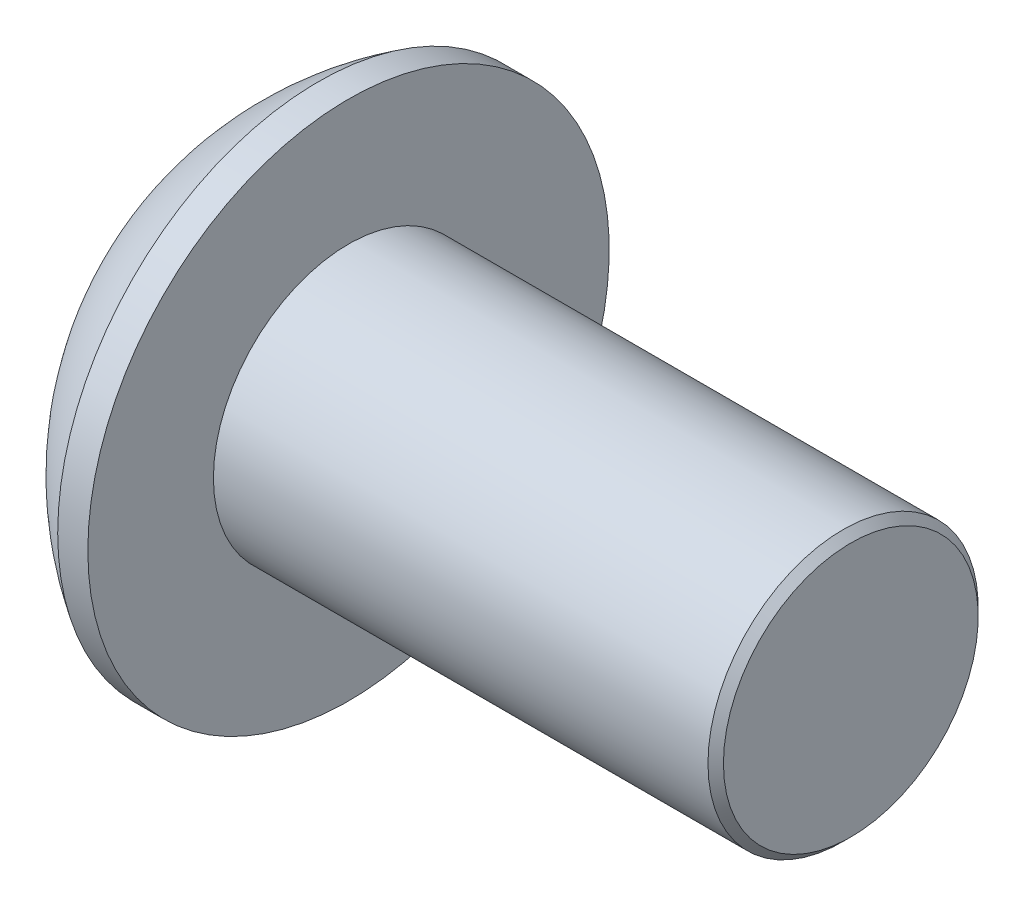
ISO-10303-21;
HEADER;
FILE_DESCRIPTION(('STEP AP214'),'2;1');
FILE_NAME('part.step','',(''),(''),'','','');
FILE_SCHEMA(('AUTOMOTIVE_DESIGN { 1 0 10303 214 1 1 1 1 }'));
ENDSEC;
DATA;
#1=APPLICATION_CONTEXT('core data for automotive mechanical design processes');
#2=APPLICATION_PROTOCOL_DEFINITION('international standard','automotive_design',2000,#1);
#3=PRODUCT_CONTEXT('',#1,'mechanical');
#4=PRODUCT('Part','Part','',(#3));
#5=PRODUCT_RELATED_PRODUCT_CATEGORY('part','',(#4));
#6=PRODUCT_DEFINITION_FORMATION('','',#4);
#7=PRODUCT_DEFINITION_CONTEXT('part definition',#1,'design');
#8=PRODUCT_DEFINITION('design','',#6,#7);
#9=PRODUCT_DEFINITION_SHAPE('','',#8);
#10=(LENGTH_UNIT() NAMED_UNIT(*) SI_UNIT(.MILLI.,.METRE.));
#11=(NAMED_UNIT(*) PLANE_ANGLE_UNIT() SI_UNIT($,.RADIAN.));
#12=(NAMED_UNIT(*) SI_UNIT($,.STERADIAN.) SOLID_ANGLE_UNIT());
#13=UNCERTAINTY_MEASURE_WITH_UNIT(LENGTH_MEASURE(1.E-05),#10,'distance_accuracy_value','');
#14=(GEOMETRIC_REPRESENTATION_CONTEXT(3) GLOBAL_UNCERTAINTY_ASSIGNED_CONTEXT((#13)) GLOBAL_UNIT_ASSIGNED_CONTEXT((#10,
#11,#12)) REPRESENTATION_CONTEXT('',''));
#15=CARTESIAN_POINT('',(0.,0.,0.));
#16=DIRECTION('',(0.,0.,1.));
#17=DIRECTION('',(1.,0.,0.));
#18=AXIS2_PLACEMENT_3D('',#15,#16,#17);
#19=CARTESIAN_POINT('',(8.2042,0.,0.));
#20=DIRECTION('',(-1.,0.,0.));
#21=DIRECTION('',(0.,0.,1.));
#22=AXIS2_PLACEMENT_3D('',#19,#20,#21);
#23=PLANE('',#22);
#24=CARTESIAN_POINT('',(8.20419999990918,0.,0.));
#25=DIRECTION('',(-1.,0.,0.));
#26=DIRECTION('',(0.,0.,1.));
#27=AXIS2_PLACEMENT_3D('',#24,#25,#26);
#28=CIRCLE('',#27,1.6103600000292);
#29=CARTESIAN_POINT('',(8.20419999990918,0.,1.61036000002918));
#30=VERTEX_POINT('',#29);
#31=EDGE_CURVE('E21',#30,#30,#28,.T.);
#32=ORIENTED_EDGE('',*,*,#31,.F.);
#33=EDGE_LOOP('',(#32));
#34=FACE_BOUND('',#33,.T.);
#35=ADVANCED_FACE('F17',(#34),#23,.F.);
#36=CARTESIAN_POINT('',(8.10641000015266,0.,0.));
#37=DIRECTION('',(-1.,0.,0.));
#38=DIRECTION('',(0.,0.,1.));
#39=AXIS2_PLACEMENT_3D('',#36,#37,#38);
#40=CONICAL_SURFACE('',#39,1.70814999972888,0.785398163106808);
#41=ORIENTED_EDGE('',*,*,#31,.T.);
#42=EDGE_LOOP('',(#41));
#43=FACE_BOUND('',#42,.T.);
#44=CARTESIAN_POINT('',(8.10641000047,0.,0.));
#45=DIRECTION('',(-1.,0.,0.));
#46=DIRECTION('',(0.,0.,1.));
#47=AXIS2_PLACEMENT_3D('',#44,#45,#46);
#48=CIRCLE('',#47,1.70815);
#49=CARTESIAN_POINT('',(8.10641000047,0.,1.70815));
#50=VERTEX_POINT('',#49);
#51=EDGE_CURVE('E109',#50,#50,#48,.T.);
#52=ORIENTED_EDGE('',*,*,#51,.F.);
#53=EDGE_LOOP('',(#52));
#54=FACE_BOUND('',#53,.T.);
#55=ADVANCED_FACE('F325',(#43,#54),#40,.T.);
#56=CARTESIAN_POINT('',(1.32080000014412,0.,0.));
#57=DIRECTION('',(-1.,0.,0.));
#58=DIRECTION('',(0.,0.,1.));
#59=AXIS2_PLACEMENT_3D('',#56,#57,#58);
#60=CONICAL_SURFACE('',#59,1.1937999997258,1.04719755090695);
#61=CARTESIAN_POINT('',(2.01004075140077,0.,3.41060513164848E-10));
#62=VERTEX_POINT('',#61);
#63=VERTEX_LOOP('',#62);
#64=FACE_BOUND('',#63,.T.);
#65=CARTESIAN_POINT('',(1.32079999998002,0.,0.));
#66=DIRECTION('',(-1.,0.,0.));
#67=DIRECTION('',(0.,0.,1.));
#68=AXIS2_PLACEMENT_3D('',#65,#66,#67);
#69=CIRCLE('',#68,1.19380000001001);
#70=CARTESIAN_POINT('',(1.32079999999001,-1.03386112704374,0.596900000002157));
#71=VERTEX_POINT('',#70);
#72=CARTESIAN_POINT('',(1.32079999999762,0.,1.1937999999933));
#73=VERTEX_POINT('',#72);
#74=EDGE_CURVE('E94',#71,#73,#69,.T.);
#75=ORIENTED_EDGE('',*,*,#74,.T.);
#76=CARTESIAN_POINT('',(1.32079999998002,0.,0.));
#77=DIRECTION('',(-1.,0.,0.));
#78=DIRECTION('',(0.,0.,1.));
#79=AXIS2_PLACEMENT_3D('',#76,#77,#78);
#80=CIRCLE('',#79,1.19380000001001);
#81=CARTESIAN_POINT('',(1.32079999999001,1.0338611271453,0.596899999814944));
#82=VERTEX_POINT('',#81);
#83=EDGE_CURVE('E88',#73,#82,#80,.T.);
#84=ORIENTED_EDGE('',*,*,#83,.T.);
#85=CARTESIAN_POINT('',(1.32079999998003,0.,0.));
#86=DIRECTION('',(-1.,0.,0.));
#87=DIRECTION('',(0.,0.,1.));
#88=AXIS2_PLACEMENT_3D('',#85,#86,#87);
#89=CIRCLE('',#88,1.19380000001001);
#90=CARTESIAN_POINT('',(1.32079999999001,1.03386112693203,-0.59690000018794));
#91=VERTEX_POINT('',#90);
#92=EDGE_CURVE('E91',#82,#91,#89,.T.);
#93=ORIENTED_EDGE('',*,*,#92,.T.);
#94=CARTESIAN_POINT('',(1.32079999998002,0.,0.));
#95=DIRECTION('',(-1.,0.,0.));
#96=DIRECTION('',(0.,0.,1.));
#97=AXIS2_PLACEMENT_3D('',#94,#95,#96);
#98=CIRCLE('',#97,1.19380000001001);
#99=CARTESIAN_POINT('',(1.32079999999762,0.,-1.1937999999933));
#100=VERTEX_POINT('',#99);
#101=EDGE_CURVE('E153',#91,#100,#98,.T.);
#102=ORIENTED_EDGE('',*,*,#101,.T.);
#103=CARTESIAN_POINT('',(1.32079999998002,0.,0.));
#104=DIRECTION('',(-1.,0.,0.));
#105=DIRECTION('',(0.,0.,1.));
#106=AXIS2_PLACEMENT_3D('',#103,#104,#105);
#107=CIRCLE('',#106,1.19380000001001);
#108=CARTESIAN_POINT('',(1.32079999999001,-1.03386112704296,-0.596900000001708));
#109=VERTEX_POINT('',#108);
#110=EDGE_CURVE('E155',#100,#109,#107,.T.);
#111=ORIENTED_EDGE('',*,*,#110,.T.);
#112=CARTESIAN_POINT('',(1.32079999998002,0.,0.));
#113=DIRECTION('',(-1.,0.,0.));
#114=DIRECTION('',(0.,0.,1.));
#115=AXIS2_PLACEMENT_3D('',#112,#113,#114);
#116=CIRCLE('',#115,1.19380000001001);
#117=EDGE_CURVE('E157',#109,#71,#116,.T.);
#118=ORIENTED_EDGE('',*,*,#117,.T.);
#119=EDGE_LOOP('',(#75,#84,#93,#102,#111,#118));
#120=FACE_BOUND('',#119,.T.);
#121=ADVANCED_FACE('F90',(#64,#120),#60,.F.);
#122=CARTESIAN_POINT('',(0.,0.,0.));
#123=DIRECTION('',(-1.,0.,0.));
#124=DIRECTION('',(0.,0.,1.));
#125=AXIS2_PLACEMENT_3D('',#122,#123,#124);
#126=CYLINDRICAL_SURFACE('',#125,1.70815);
#127=ORIENTED_EDGE('',*,*,#51,.T.);
#128=EDGE_LOOP('',(#127));
#129=FACE_BOUND('',#128,.T.);
#130=CARTESIAN_POINT('',(1.85419999994,0.,0.));
#131=DIRECTION('',(-1.,0.,0.));
#132=DIRECTION('',(0.,0.,1.));
#133=AXIS2_PLACEMENT_3D('',#130,#131,#132);
#134=CIRCLE('',#133,1.70815);
#135=CARTESIAN_POINT('',(1.85419999994,0.,1.70815));
#136=VERTEX_POINT('',#135);
#137=EDGE_CURVE('E150',#136,#136,#134,.F.);
#138=ORIENTED_EDGE('',*,*,#137,.T.);
#139=EDGE_LOOP('',(#138));
#140=FACE_BOUND('',#139,.T.);
#141=ADVANCED_FACE('F319',(#129,#140),#126,.T.);
#142=CARTESIAN_POINT('',(1.3208,-2.06772225408,-1.1938));
#143=DIRECTION('',(1.,0.,0.));
#144=DIRECTION('',(0.,0.,-1.));
#145=AXIS2_PLACEMENT_3D('',#142,#143,#144);
#146=PLANE('',#145);
#147=DIRECTION('',(0.,-0.50000000000019,-0.866025403784329));
#148=VECTOR('',#147,1.);
#149=CARTESIAN_POINT('',(1.3208,1.37848150272,0.));
#150=LINE('',#149,#148);
#151=CARTESIAN_POINT('',(1.3208,1.37848150279077,-3.72750191326289E-10));
#152=VERTEX_POINT('',#151);
#153=EDGE_CURVE('E107',#91,#152,#150,.F.);
#154=ORIENTED_EDGE('',*,*,#153,.F.);
#155=ORIENTED_EDGE('',*,*,#92,.F.);
#156=DIRECTION('',(0.,0.50000000000019,-0.866025403784329));
#157=VECTOR('',#156,1.);
#158=CARTESIAN_POINT('',(1.3208,0.689240751359,1.1938));
#159=LINE('',#158,#157);
#160=EDGE_CURVE('E105',#152,#82,#159,.F.);
#161=ORIENTED_EDGE('',*,*,#160,.F.);
#162=EDGE_LOOP('',(#154,#155,#161));
#163=FACE_BOUND('',#162,.T.);
#164=ADVANCED_FACE('F103',(#163),#146,.F.);
#165=CARTESIAN_POINT('',(1.3208,-2.06772225408,-1.1938));
#166=DIRECTION('',(1.,0.,0.));
#167=DIRECTION('',(0.,0.,-1.));
#168=AXIS2_PLACEMENT_3D('',#165,#166,#167);
#169=PLANE('',#168);
#170=DIRECTION('',(0.,0.50000000000019,-0.866025403784329));
#171=VECTOR('',#170,1.);
#172=CARTESIAN_POINT('',(1.3208,0.689240751359,1.1938));
#173=LINE('',#172,#171);
#174=CARTESIAN_POINT('',(1.3208,0.689240751645,1.1938));
#175=VERTEX_POINT('',#174);
#176=EDGE_CURVE('E110',#82,#175,#173,.F.);
#177=ORIENTED_EDGE('',*,*,#176,.F.);
#178=ORIENTED_EDGE('',*,*,#83,.F.);
#179=DIRECTION('',(0.,1.,0.));
#180=VECTOR('',#179,1.);
#181=CARTESIAN_POINT('',(1.3208,-0.689240751359,1.1938));
#182=LINE('',#181,#180);
#183=EDGE_CURVE('E113',#175,#73,#182,.F.);
#184=ORIENTED_EDGE('',*,*,#183,.F.);
#185=EDGE_LOOP('',(#177,#178,#184));
#186=FACE_BOUND('',#185,.T.);
#187=ADVANCED_FACE('F111',(#186),#169,.F.);
#188=CARTESIAN_POINT('',(1.3208,-2.06772225408,-1.1938));
#189=DIRECTION('',(1.,0.,0.));
#190=DIRECTION('',(0.,0.,-1.));
#191=AXIS2_PLACEMENT_3D('',#188,#189,#190);
#192=PLANE('',#191);
#193=DIRECTION('',(0.,1.,0.));
#194=VECTOR('',#193,1.);
#195=CARTESIAN_POINT('',(1.3208,-0.689240751359,1.1938));
#196=LINE('',#195,#194);
#197=CARTESIAN_POINT('',(1.3208,-0.689240751152527,1.19380000011176));
#198=VERTEX_POINT('',#197);
#199=EDGE_CURVE('E171',#73,#198,#196,.F.);
#200=ORIENTED_EDGE('',*,*,#199,.F.);
#201=ORIENTED_EDGE('',*,*,#74,.F.);
#202=DIRECTION('',(0.,0.50000000000019,0.866025403784329));
#203=VECTOR('',#202,1.);
#204=CARTESIAN_POINT('',(1.3208,-1.37848150272,0.));
#205=LINE('',#204,#203);
#206=EDGE_CURVE('E169',#198,#71,#205,.F.);
#207=ORIENTED_EDGE('',*,*,#206,.F.);
#208=EDGE_LOOP('',(#200,#201,#207));
#209=FACE_BOUND('',#208,.T.);
#210=ADVANCED_FACE('F167',(#209),#192,.F.);
#211=CARTESIAN_POINT('',(1.3208,-2.06772225408,-1.1938));
#212=DIRECTION('',(1.,0.,0.));
#213=DIRECTION('',(0.,0.,-1.));
#214=AXIS2_PLACEMENT_3D('',#211,#212,#213);
#215=PLANE('',#214);
#216=DIRECTION('',(0.,0.50000000000019,0.866025403784329));
#217=VECTOR('',#216,1.);
#218=CARTESIAN_POINT('',(1.3208,-1.37848150272,0.));
#219=LINE('',#218,#217);
#220=CARTESIAN_POINT('',(1.3208,-1.37848150279077,3.72750191326289E-10));
#221=VERTEX_POINT('',#220);
#222=EDGE_CURVE('E172',#71,#221,#219,.F.);
#223=ORIENTED_EDGE('',*,*,#222,.F.);
#224=ORIENTED_EDGE('',*,*,#117,.F.);
#225=DIRECTION('',(0.,-0.50000000000019,0.866025403784329));
#226=VECTOR('',#225,1.);
#227=CARTESIAN_POINT('',(1.3208,-0.689240751359,-1.1938));
#228=LINE('',#227,#226);
#229=EDGE_CURVE('E175',#221,#109,#228,.F.);
#230=ORIENTED_EDGE('',*,*,#229,.F.);
#231=EDGE_LOOP('',(#223,#224,#230));
#232=FACE_BOUND('',#231,.T.);
#233=ADVANCED_FACE('F173',(#232),#215,.F.);
#234=CARTESIAN_POINT('',(1.3208,-2.06772225408,-1.1938));
#235=DIRECTION('',(1.,0.,0.));
#236=DIRECTION('',(0.,0.,-1.));
#237=AXIS2_PLACEMENT_3D('',#234,#235,#236);
#238=PLANE('',#237);
#239=DIRECTION('',(0.,-0.50000000000019,0.866025403784329));
#240=VECTOR('',#239,1.);
#241=CARTESIAN_POINT('',(1.3208,-0.689240751359,-1.1938));
#242=LINE('',#241,#240);
#243=CARTESIAN_POINT('',(1.3208,-0.6892407517165,-1.19379999987616));
#244=VERTEX_POINT('',#243);
#245=EDGE_CURVE('E231',#109,#244,#242,.F.);
#246=ORIENTED_EDGE('',*,*,#245,.F.);
#247=ORIENTED_EDGE('',*,*,#110,.F.);
#248=DIRECTION('',(0.,-1.,0.));
#249=VECTOR('',#248,1.);
#250=CARTESIAN_POINT('',(1.3208,0.689240751359,-1.1938));
#251=LINE('',#250,#249);
#252=EDGE_CURVE('E243',#244,#100,#251,.F.);
#253=ORIENTED_EDGE('',*,*,#252,.F.);
#254=EDGE_LOOP('',(#246,#247,#253));
#255=FACE_BOUND('',#254,.T.);
#256=ADVANCED_FACE('F264',(#255),#238,.F.);
#257=CARTESIAN_POINT('',(1.3208,-2.06772225408,-1.1938));
#258=DIRECTION('',(1.,0.,0.));
#259=DIRECTION('',(0.,0.,-1.));
#260=AXIS2_PLACEMENT_3D('',#257,#258,#259);
#261=PLANE('',#260);
#262=DIRECTION('',(0.,-1.,0.));
#263=VECTOR('',#262,1.);
#264=CARTESIAN_POINT('',(1.3208,0.689240751359,-1.1938));
#265=LINE('',#264,#263);
#266=CARTESIAN_POINT('',(1.3208,0.689240751117687,-1.19380000001943));
#267=VERTEX_POINT('',#266);
#268=EDGE_CURVE('E251',#100,#267,#265,.F.);
#269=ORIENTED_EDGE('',*,*,#268,.F.);
#270=ORIENTED_EDGE('',*,*,#101,.F.);
#271=DIRECTION('',(0.,-0.50000000000019,-0.866025403784329));
#272=VECTOR('',#271,1.);
#273=CARTESIAN_POINT('',(1.3208,1.37848150272,0.));
#274=LINE('',#273,#272);
#275=EDGE_CURVE('E132',#267,#91,#274,.F.);
#276=ORIENTED_EDGE('',*,*,#275,.F.);
#277=EDGE_LOOP('',(#269,#270,#276));
#278=FACE_BOUND('',#277,.T.);
#279=ADVANCED_FACE('F266',(#278),#261,.F.);
#280=CARTESIAN_POINT('',(1.8542,1.70815,0.));
#281=DIRECTION('',(-1.,0.,0.));
#282=DIRECTION('',(0.,0.,1.));
#283=AXIS2_PLACEMENT_3D('',#280,#281,#282);
#284=PLANE('',#283);
#285=ORIENTED_EDGE('',*,*,#137,.F.);
#286=EDGE_LOOP('',(#285));
#287=FACE_BOUND('',#286,.T.);
#288=CARTESIAN_POINT('',(1.85419999994,0.,0.));
#289=DIRECTION('',(-1.,0.,0.));
#290=DIRECTION('',(0.,0.,1.));
#291=AXIS2_PLACEMENT_3D('',#288,#289,#290);
#292=CIRCLE('',#291,3.29565);
#293=CARTESIAN_POINT('',(1.85419999994,0.,3.29565));
#294=VERTEX_POINT('',#293);
#295=EDGE_CURVE('E139',#294,#294,#292,.T.);
#296=ORIENTED_EDGE('',*,*,#295,.F.);
#297=EDGE_LOOP('',(#296));
#298=FACE_BOUND('',#297,.T.);
#299=ADVANCED_FACE('F296',(#287,#298),#284,.F.);
#300=CARTESIAN_POINT('',(1.3208,1.37848150272,0.));
#301=DIRECTION('',(0.,-0.866025403784329,0.50000000000019));
#302=DIRECTION('',(0.,-0.50000000000019,-0.866025403784329));
#303=AXIS2_PLACEMENT_3D('',#300,#301,#302);
#304=PLANE('',#303);
#305=ORIENTED_EDGE('',*,*,#153,.T.);
#306=DIRECTION('',(1.,0.,0.));
#307=VECTOR('',#306,1.);
#308=CARTESIAN_POINT('',(1.3208,1.37848150293344,-3.73289723784587E-10));
#309=LINE('',#308,#307);
#310=CARTESIAN_POINT('',(0.,1.37848150322979,-1.40005978913457E-10));
#311=VERTEX_POINT('',#310);
#312=EDGE_CURVE('E120',#311,#152,#309,.T.);
#313=ORIENTED_EDGE('',*,*,#312,.F.);
#314=DIRECTION('',(0.,0.500000000088179,0.866025403733529));
#315=VECTOR('',#314,1.);
#316=CARTESIAN_POINT('',(0.,0.689240751788,-1.19380000047));
#317=LINE('',#316,#315);
#318=CARTESIAN_POINT('',(0.,0.689240751311395,-1.19380000020132));
#319=VERTEX_POINT('',#318);
#320=EDGE_CURVE('E135',#319,#311,#317,.T.);
#321=ORIENTED_EDGE('',*,*,#320,.F.);
#322=DIRECTION('',(1.,0.,0.));
#323=VECTOR('',#322,1.);
#324=CARTESIAN_POINT('',(1.3208,0.689240750929,-1.1938));
#325=LINE('',#324,#323);
#326=EDGE_CURVE('E149',#267,#319,#325,.F.);
#327=ORIENTED_EDGE('',*,*,#326,.F.);
#328=ORIENTED_EDGE('',*,*,#275,.T.);
#329=EDGE_LOOP('',(#305,#313,#321,#327,#328));
#330=FACE_BOUND('',#329,.T.);
#331=ADVANCED_FACE('F269',(#330),#304,.T.);
#332=CARTESIAN_POINT('',(1.3208,0.689240751359,1.1938));
#333=DIRECTION('',(0.,-0.866025403784329,-0.50000000000019));
#334=DIRECTION('',(0.,0.50000000000019,-0.866025403784329));
#335=AXIS2_PLACEMENT_3D('',#332,#333,#334);
#336=PLANE('',#335);
#337=ORIENTED_EDGE('',*,*,#176,.T.);
#338=DIRECTION('',(1.,0.,0.));
#339=VECTOR('',#338,1.);
#340=CARTESIAN_POINT('',(1.3208,0.689240751788,1.1938));
#341=LINE('',#340,#339);
#342=CARTESIAN_POINT('',(0.,0.68924075168075,1.193800000235));
#343=VERTEX_POINT('',#342);
#344=EDGE_CURVE('E116',#343,#175,#341,.T.);
#345=ORIENTED_EDGE('',*,*,#344,.F.);
#346=DIRECTION('',(0.,-0.500000000088179,0.866025403733529));
#347=VECTOR('',#346,1.);
#348=CARTESIAN_POINT('',(0.,1.37848150358,0.));
#349=LINE('',#348,#347);
#350=EDGE_CURVE('E138',#311,#343,#349,.T.);
#351=ORIENTED_EDGE('',*,*,#350,.F.);
#352=ORIENTED_EDGE('',*,*,#312,.T.);
#353=ORIENTED_EDGE('',*,*,#160,.T.);
#354=EDGE_LOOP('',(#337,#345,#351,#352,#353));
#355=FACE_BOUND('',#354,.T.);
#356=ADVANCED_FACE('F118',(#355),#336,.T.);
#357=CARTESIAN_POINT('',(1.3208,-0.689240751359,1.1938));
#358=DIRECTION('',(0.,0.,-1.));
#359=DIRECTION('',(0.,1.,0.));
#360=AXIS2_PLACEMENT_3D('',#357,#358,#359);
#361=PLANE('',#360);
#362=ORIENTED_EDGE('',*,*,#199,.T.);
#363=DIRECTION('',(1.,0.,0.));
#364=VECTOR('',#363,1.);
#365=CARTESIAN_POINT('',(1.3208,-0.689240751264291,1.19380000016764));
#366=LINE('',#365,#364);
#367=CARTESIAN_POINT('',(0.,-0.689240751523337,1.19380000032368));
#368=VERTEX_POINT('',#367);
#369=EDGE_CURVE('E182',#368,#198,#366,.T.);
#370=ORIENTED_EDGE('',*,*,#369,.F.);
#371=DIRECTION('',(0.,1.,0.));
#372=VECTOR('',#371,1.);
#373=CARTESIAN_POINT('',(0.,0.,1.19380000047));
#374=LINE('',#373,#372);
#375=EDGE_CURVE('E196',#343,#368,#374,.F.);
#376=ORIENTED_EDGE('',*,*,#375,.F.);
#377=ORIENTED_EDGE('',*,*,#344,.T.);
#378=ORIENTED_EDGE('',*,*,#183,.T.);
#379=EDGE_LOOP('',(#362,#370,#376,#377,#378));
#380=FACE_BOUND('',#379,.T.);
#381=ADVANCED_FACE('F219',(#380),#361,.T.);
#382=CARTESIAN_POINT('',(1.3208,-1.37848150272,0.));
#383=DIRECTION('',(0.,0.866025403784329,-0.50000000000019));
#384=DIRECTION('',(0.,0.50000000000019,0.866025403784329));
#385=AXIS2_PLACEMENT_3D('',#382,#383,#384);
#386=PLANE('',#385);
#387=ORIENTED_EDGE('',*,*,#222,.T.);
#388=DIRECTION('',(1.,0.,0.));
#389=VECTOR('',#388,1.);
#390=CARTESIAN_POINT('',(1.3208,-1.37848150293344,3.73289723784587E-10));
#391=LINE('',#390,#389);
#392=CARTESIAN_POINT('',(0.,-1.37848150322979,1.40005978913457E-10));
#393=VERTEX_POINT('',#392);
#394=EDGE_CURVE('E178',#393,#221,#391,.T.);
#395=ORIENTED_EDGE('',*,*,#394,.F.);
#396=DIRECTION('',(0.,-0.500000000088179,-0.866025403733529));
#397=VECTOR('',#396,1.);
#398=CARTESIAN_POINT('',(0.,-0.689240751788,1.19380000047));
#399=LINE('',#398,#397);
#400=EDGE_CURVE('E199',#368,#393,#399,.T.);
#401=ORIENTED_EDGE('',*,*,#400,.F.);
#402=ORIENTED_EDGE('',*,*,#369,.T.);
#403=ORIENTED_EDGE('',*,*,#206,.T.);
#404=EDGE_LOOP('',(#387,#395,#401,#402,#403));
#405=FACE_BOUND('',#404,.T.);
#406=ADVANCED_FACE('F180',(#405),#386,.T.);
#407=CARTESIAN_POINT('',(1.3208,-0.689240751359,-1.1938));
#408=DIRECTION('',(0.,0.866025403784329,0.50000000000019));
#409=DIRECTION('',(0.,-0.50000000000019,0.866025403784329));
#410=AXIS2_PLACEMENT_3D('',#407,#408,#409);
#411=PLANE('',#410);
#412=ORIENTED_EDGE('',*,*,#245,.T.);
#413=DIRECTION('',(1.,0.,0.));
#414=VECTOR('',#413,1.);
#415=CARTESIAN_POINT('',(1.3208,-0.689240751788,-1.1938));
#416=LINE('',#415,#414);
#417=CARTESIAN_POINT('',(0.,-0.689240751788,-1.1938));
#418=VERTEX_POINT('',#417);
#419=EDGE_CURVE('E36',#418,#244,#416,.T.);
#420=ORIENTED_EDGE('',*,*,#419,.F.);
#421=DIRECTION('',(0.,0.500000000088179,-0.866025403733529));
#422=VECTOR('',#421,1.);
#423=CARTESIAN_POINT('',(0.,-1.37848150358,0.));
#424=LINE('',#423,#422);
#425=EDGE_CURVE('E220',#393,#418,#424,.T.);
#426=ORIENTED_EDGE('',*,*,#425,.F.);
#427=ORIENTED_EDGE('',*,*,#394,.T.);
#428=ORIENTED_EDGE('',*,*,#229,.T.);
#429=EDGE_LOOP('',(#412,#420,#426,#427,#428));
#430=FACE_BOUND('',#429,.T.);
#431=ADVANCED_FACE('F270',(#430),#411,.T.);
#432=CARTESIAN_POINT('',(1.3208,0.689240751359,-1.1938));
#433=DIRECTION('',(0.,0.,1.));
#434=DIRECTION('',(0.,-1.,0.));
#435=AXIS2_PLACEMENT_3D('',#432,#433,#434);
#436=PLANE('',#435);
#437=ORIENTED_EDGE('',*,*,#268,.T.);
#438=ORIENTED_EDGE('',*,*,#326,.T.);
#439=DIRECTION('',(0.,1.,0.));
#440=VECTOR('',#439,1.);
#441=CARTESIAN_POINT('',(0.,0.,-1.19380000047));
#442=LINE('',#441,#440);
#443=EDGE_CURVE('E146',#418,#319,#442,.T.);
#444=ORIENTED_EDGE('',*,*,#443,.F.);
#445=ORIENTED_EDGE('',*,*,#419,.T.);
#446=ORIENTED_EDGE('',*,*,#252,.T.);
#447=EDGE_LOOP('',(#437,#438,#444,#445,#446));
#448=FACE_BOUND('',#447,.T.);
#449=ADVANCED_FACE('F261',(#448),#436,.T.);
#450=CARTESIAN_POINT('',(0.,0.,0.));
#451=DIRECTION('',(-1.,0.,0.));
#452=DIRECTION('',(0.,0.,1.));
#453=AXIS2_PLACEMENT_3D('',#450,#451,#452);
#454=CYLINDRICAL_SURFACE('',#453,3.29565);
#455=CARTESIAN_POINT('',(1.47320000082,0.,0.));
#456=DIRECTION('',(-1.,0.,0.));
#457=DIRECTION('',(0.,0.,1.));
#458=AXIS2_PLACEMENT_3D('',#455,#456,#457);
#459=CIRCLE('',#458,3.29565);
#460=CARTESIAN_POINT('',(1.47320000082,0.,3.29565));
#461=VERTEX_POINT('',#460);
#462=EDGE_CURVE('E27',#461,#461,#459,.T.);
#463=ORIENTED_EDGE('',*,*,#462,.F.);
#464=EDGE_LOOP('',(#463));
#465=FACE_BOUND('',#464,.T.);
#466=ORIENTED_EDGE('',*,*,#295,.T.);
#467=EDGE_LOOP('',(#466));
#468=FACE_BOUND('',#467,.T.);
#469=ADVANCED_FACE('F278',(#465,#468),#454,.T.);
#470=CARTESIAN_POINT('',(0.,0.,0.));
#471=DIRECTION('',(-1.,0.,0.));
#472=DIRECTION('',(0.,0.,1.));
#473=AXIS2_PLACEMENT_3D('',#470,#471,#472);
#474=PLANE('',#473);
#475=ORIENTED_EDGE('',*,*,#425,.T.);
#476=ORIENTED_EDGE('',*,*,#443,.T.);
#477=ORIENTED_EDGE('',*,*,#320,.T.);
#478=ORIENTED_EDGE('',*,*,#350,.T.);
#479=ORIENTED_EDGE('',*,*,#375,.T.);
#480=ORIENTED_EDGE('',*,*,#400,.T.);
#481=EDGE_LOOP('',(#475,#476,#477,#478,#479,#480));
#482=FACE_BOUND('',#481,.T.);
#483=CARTESIAN_POINT('',(0.,-2.95575196262998E-12,-2.85817376710629E-12));
#484=DIRECTION('',(-1.,0.,0.));
#485=DIRECTION('',(0.,0.,1.));
#486=AXIS2_PLACEMENT_3D('',#483,#484,#485);
#487=CIRCLE('',#486,1.647825);
#488=CARTESIAN_POINT('',(0.,-2.95575196262998E-12,1.64782499999714));
#489=VERTEX_POINT('',#488);
#490=EDGE_CURVE('E11',#489,#489,#487,.F.);
#491=ORIENTED_EDGE('',*,*,#490,.F.);
#492=EDGE_LOOP('',(#491));
#493=FACE_BOUND('',#492,.T.);
#494=ADVANCED_FACE('F212',(#482,#493),#474,.T.);
#495=CARTESIAN_POINT('',(3.50132362606979,-2.95575196262998E-12,-2.85817376710629E-12));
#496=DIRECTION('',(0.,1.,0.));
#497=DIRECTION('',(-0.511318777659023,0.,-0.859391126096426));
#498=AXIS2_PLACEMENT_3D('',#495,#496,#497);
#499=SPHERICAL_SURFACE('',#498,3.86970210288847);
#500=CARTESIAN_POINT('',(3.50132362606979,-2.95575196262998E-12,-2.85817376710629E-12));
#501=DIRECTION('',(-1.,0.,0.));
#502=DIRECTION('',(0.,0.,1.));
#503=AXIS2_PLACEMENT_3D('',#500,#501,#502);
#504=SPHERICAL_SURFACE('',#503,3.86970210288847);
#505=ORIENTED_EDGE('',*,*,#490,.T.);
#506=EDGE_LOOP('',(#505));
#507=FACE_BOUND('',#506,.T.);
#508=ORIENTED_EDGE('',*,*,#462,.T.);
#509=EDGE_LOOP('',(#508));
#510=FACE_BOUND('',#509,.T.);
#511=ADVANCED_FACE('F19',(#507,#510),#504,.T.);
#512=CLOSED_SHELL('',(#35,#55,#121,#141,#164,#187,#210,#233,#256,#279,#299,#331,#356,#381,#406,
#431,#449,#469,#494,#511));
#513=MANIFOLD_SOLID_BREP('B1',#512);
#514=ADVANCED_BREP_SHAPE_REPRESENTATION('',(#18,#513),#14);
#515=SHAPE_DEFINITION_REPRESENTATION(#9,#514);
ENDSEC;
END-ISO-10303-21;
